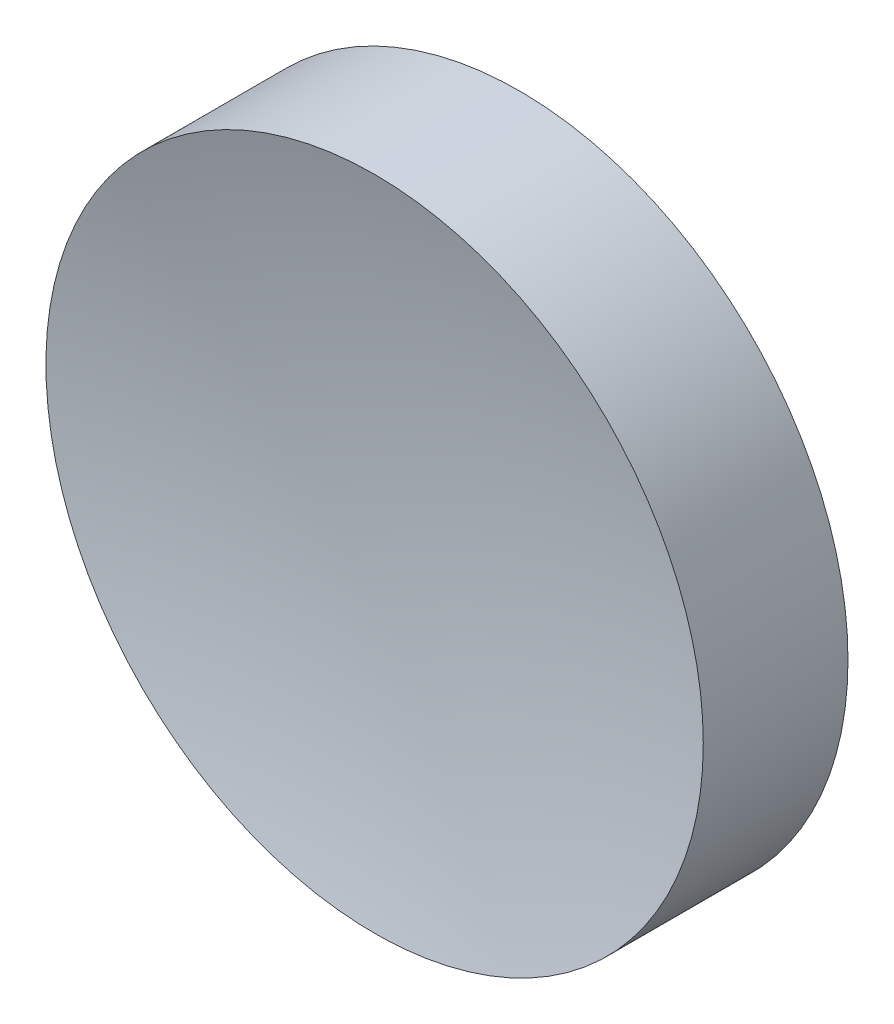
ISO-10303-21;
HEADER;
FILE_DESCRIPTION(('STEP AP214'),'2;1');
FILE_NAME('part.step','',(''),(''),'','','');
FILE_SCHEMA(('AUTOMOTIVE_DESIGN { 1 0 10303 214 1 1 1 1 }'));
ENDSEC;
DATA;
#1=APPLICATION_CONTEXT('core data for automotive mechanical design processes');
#2=APPLICATION_PROTOCOL_DEFINITION('international standard','automotive_design',2000,#1);
#3=PRODUCT_CONTEXT('',#1,'mechanical');
#4=PRODUCT('Part','Part','',(#3));
#5=PRODUCT_RELATED_PRODUCT_CATEGORY('part','',(#4));
#6=PRODUCT_DEFINITION_FORMATION('','',#4);
#7=PRODUCT_DEFINITION_CONTEXT('part definition',#1,'design');
#8=PRODUCT_DEFINITION('design','',#6,#7);
#9=PRODUCT_DEFINITION_SHAPE('','',#8);
#10=(LENGTH_UNIT() NAMED_UNIT(*) SI_UNIT(.MILLI.,.METRE.));
#11=(NAMED_UNIT(*) PLANE_ANGLE_UNIT() SI_UNIT($,.RADIAN.));
#12=(NAMED_UNIT(*) SI_UNIT($,.STERADIAN.) SOLID_ANGLE_UNIT());
#13=UNCERTAINTY_MEASURE_WITH_UNIT(LENGTH_MEASURE(1.E-05),#10,'distance_accuracy_value','');
#14=(GEOMETRIC_REPRESENTATION_CONTEXT(3) GLOBAL_UNCERTAINTY_ASSIGNED_CONTEXT((#13)) GLOBAL_UNIT_ASSIGNED_CONTEXT((#10,
#11,#12)) REPRESENTATION_CONTEXT('',''));
#15=CARTESIAN_POINT('',(0.,0.,0.));
#16=DIRECTION('',(0.,0.,1.));
#17=DIRECTION('',(1.,0.,0.));
#18=AXIS2_PLACEMENT_3D('',#15,#16,#17);
#19=CARTESIAN_POINT('',(0.,0.,52.6641211996733));
#20=DIRECTION('',(0.,0.,1.));
#21=DIRECTION('',(0.,1.,0.));
#22=AXIS2_PLACEMENT_3D('',#19,#20,#21);
#23=SPHERICAL_SURFACE('',#22,51.46);
#24=CARTESIAN_POINT('',(0.,0.,2.79587880032665));
#25=DIRECTION('',(0.,0.,1.));
#26=DIRECTION('',(1.,0.,0.));
#27=AXIS2_PLACEMENT_3D('',#24,#25,#26);
#28=CIRCLE('',#27,12.7);
#29=CARTESIAN_POINT('',(12.7,0.,2.79587880032665));
#30=VERTEX_POINT('',#29);
#31=EDGE_CURVE('E18',#30,#30,#28,.T.);
#32=ORIENTED_EDGE('',*,*,#31,.T.);
#33=EDGE_LOOP('',(#32));
#34=FACE_BOUND('',#33,.T.);
#35=ADVANCED_FACE('F12',(#34),#23,.F.);
#36=CARTESIAN_POINT('',(0.,0.,-2.79587880032665));
#37=DIRECTION('',(0.,0.,1.));
#38=DIRECTION('',(1.,0.,0.));
#39=AXIS2_PLACEMENT_3D('',#36,#37,#38);
#40=PLANE('',#39);
#41=CARTESIAN_POINT('',(0.,0.,-2.79587880032665));
#42=DIRECTION('',(0.,0.,1.));
#43=DIRECTION('',(1.,0.,0.));
#44=AXIS2_PLACEMENT_3D('',#41,#42,#43);
#45=CIRCLE('',#44,12.7);
#46=CARTESIAN_POINT('',(12.7,0.,-2.79587880032665));
#47=VERTEX_POINT('',#46);
#48=EDGE_CURVE('E8',#47,#47,#45,.T.);
#49=ORIENTED_EDGE('',*,*,#48,.F.);
#50=EDGE_LOOP('',(#49));
#51=FACE_BOUND('',#50,.T.);
#52=ADVANCED_FACE('F27',(#51),#40,.F.);
#53=CARTESIAN_POINT('',(0.,0.,8.22127447010267));
#54=DIRECTION('',(0.,0.,1.));
#55=DIRECTION('',(1.,0.,0.));
#56=AXIS2_PLACEMENT_3D('',#53,#54,#55);
#57=CYLINDRICAL_SURFACE('',#56,12.7);
#58=ORIENTED_EDGE('',*,*,#31,.F.);
#59=EDGE_LOOP('',(#58));
#60=FACE_BOUND('',#59,.T.);
#61=ORIENTED_EDGE('',*,*,#48,.T.);
#62=EDGE_LOOP('',(#61));
#63=FACE_BOUND('',#62,.T.);
#64=ADVANCED_FACE('F25',(#60,#63),#57,.T.);
#65=CLOSED_SHELL('',(#35,#52,#64));
#66=MANIFOLD_SOLID_BREP('B1',#65);
#67=ADVANCED_BREP_SHAPE_REPRESENTATION('',(#18,#66),#14);
#68=SHAPE_DEFINITION_REPRESENTATION(#9,#67);
ENDSEC;
END-ISO-10303-21;
